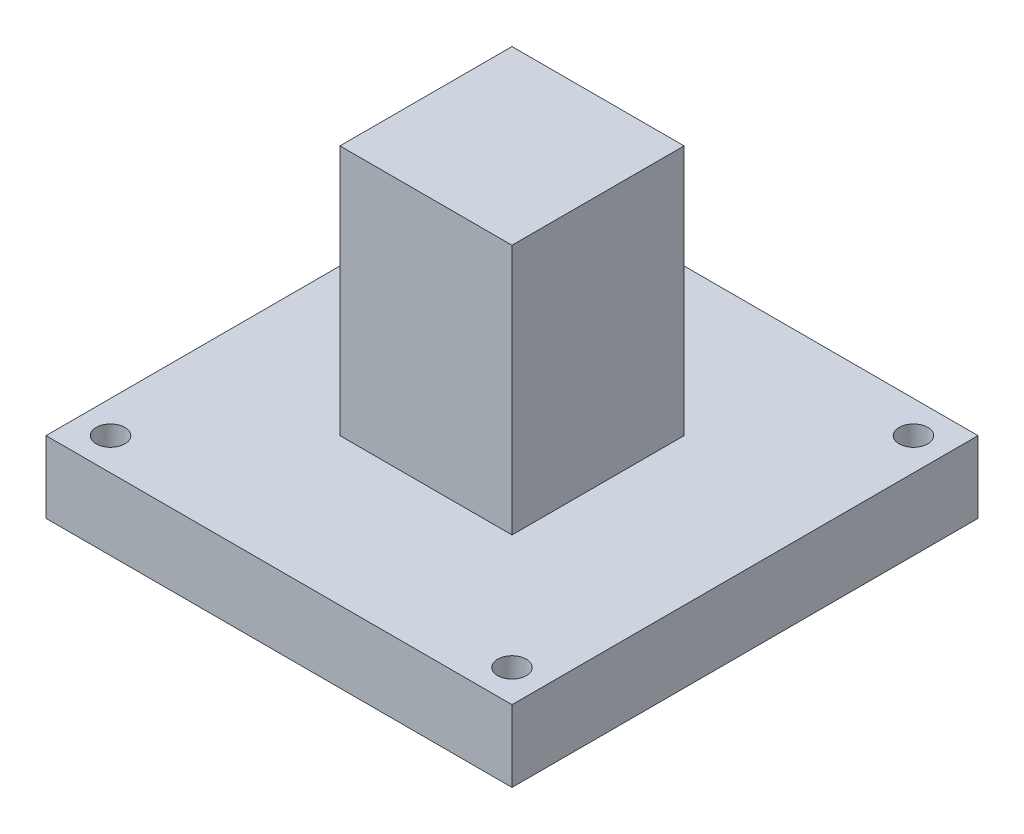
ISO-10303-21;
HEADER;
FILE_DESCRIPTION(('STEP AP214'),'2;1');
FILE_NAME('part.step','',(''),(''),'','','');
FILE_SCHEMA(('AUTOMOTIVE_DESIGN { 1 0 10303 214 1 1 1 1 }'));
ENDSEC;
DATA;
#1=APPLICATION_CONTEXT('core data for automotive mechanical design processes');
#2=APPLICATION_PROTOCOL_DEFINITION('international standard','automotive_design',2000,#1);
#3=PRODUCT_CONTEXT('',#1,'mechanical');
#4=PRODUCT('Part','Part','',(#3));
#5=PRODUCT_RELATED_PRODUCT_CATEGORY('part','',(#4));
#6=PRODUCT_DEFINITION_FORMATION('','',#4);
#7=PRODUCT_DEFINITION_CONTEXT('part definition',#1,'design');
#8=PRODUCT_DEFINITION('design','',#6,#7);
#9=PRODUCT_DEFINITION_SHAPE('','',#8);
#10=(LENGTH_UNIT() NAMED_UNIT(*) SI_UNIT(.MILLI.,.METRE.));
#11=(NAMED_UNIT(*) PLANE_ANGLE_UNIT() SI_UNIT($,.RADIAN.));
#12=(NAMED_UNIT(*) SI_UNIT($,.STERADIAN.) SOLID_ANGLE_UNIT());
#13=UNCERTAINTY_MEASURE_WITH_UNIT(LENGTH_MEASURE(1.E-05),#10,'distance_accuracy_value','');
#14=(GEOMETRIC_REPRESENTATION_CONTEXT(3) GLOBAL_UNCERTAINTY_ASSIGNED_CONTEXT((#13)) GLOBAL_UNIT_ASSIGNED_CONTEXT((#10,
#11,#12)) REPRESENTATION_CONTEXT('',''));
#15=CARTESIAN_POINT('',(0.,0.,0.));
#16=DIRECTION('',(0.,0.,1.));
#17=DIRECTION('',(1.,0.,0.));
#18=AXIS2_PLACEMENT_3D('',#15,#16,#17);
#19=CARTESIAN_POINT('',(0.,35.,0.));
#20=DIRECTION('',(1.,0.,0.));
#21=DIRECTION('',(0.,0.,-1.));
#22=AXIS2_PLACEMENT_3D('',#19,#20,#21);
#23=PLANE('',#22);
#24=DIRECTION('',(0.,0.,1.));
#25=VECTOR('',#24,1.);
#26=CARTESIAN_POINT('',(0.,0.,0.));
#27=LINE('',#26,#25);
#28=CARTESIAN_POINT('',(0.,0.,-24.));
#29=VERTEX_POINT('',#28);
#30=CARTESIAN_POINT('',(0.,0.,0.));
#31=VERTEX_POINT('',#30);
#32=EDGE_CURVE('E129',#29,#31,#27,.T.);
#33=ORIENTED_EDGE('',*,*,#32,.T.);
#34=DIRECTION('',(0.,-1.,0.));
#35=VECTOR('',#34,1.);
#36=CARTESIAN_POINT('',(0.,35.,0.));
#37=LINE('',#36,#35);
#38=CARTESIAN_POINT('',(0.,35.,0.));
#39=VERTEX_POINT('',#38);
#40=EDGE_CURVE('E11',#39,#31,#37,.T.);
#41=ORIENTED_EDGE('',*,*,#40,.F.);
#42=DIRECTION('',(0.,0.,1.));
#43=VECTOR('',#42,1.);
#44=CARTESIAN_POINT('',(0.,35.,0.));
#45=LINE('',#44,#43);
#46=CARTESIAN_POINT('',(0.,35.,-24.));
#47=VERTEX_POINT('',#46);
#48=EDGE_CURVE('E140',#47,#39,#45,.T.);
#49=ORIENTED_EDGE('',*,*,#48,.F.);
#50=DIRECTION('',(0.,-1.,0.));
#51=VECTOR('',#50,1.);
#52=CARTESIAN_POINT('',(0.,35.,-24.));
#53=LINE('',#52,#51);
#54=EDGE_CURVE('E151',#47,#29,#53,.T.);
#55=ORIENTED_EDGE('',*,*,#54,.T.);
#56=EDGE_LOOP('',(#33,#41,#49,#55));
#57=FACE_BOUND('',#56,.T.);
#58=ADVANCED_FACE('F39',(#57),#23,.F.);
#59=CARTESIAN_POINT('',(0.,35.,0.));
#60=DIRECTION('',(0.,0.,-1.));
#61=DIRECTION('',(-1.,0.,0.));
#62=AXIS2_PLACEMENT_3D('',#59,#60,#61);
#63=PLANE('',#62);
#64=DIRECTION('',(1.,0.,0.));
#65=VECTOR('',#64,1.);
#66=CARTESIAN_POINT('',(0.,0.,0.));
#67=LINE('',#66,#65);
#68=CARTESIAN_POINT('',(24.,0.,0.));
#69=VERTEX_POINT('',#68);
#70=EDGE_CURVE('E134',#31,#69,#67,.T.);
#71=ORIENTED_EDGE('',*,*,#70,.T.);
#72=DIRECTION('',(0.,-1.,0.));
#73=VECTOR('',#72,1.);
#74=CARTESIAN_POINT('',(24.,35.,0.));
#75=LINE('',#74,#73);
#76=CARTESIAN_POINT('',(24.,35.,0.));
#77=VERTEX_POINT('',#76);
#78=EDGE_CURVE('E48',#77,#69,#75,.T.);
#79=ORIENTED_EDGE('',*,*,#78,.F.);
#80=DIRECTION('',(1.,0.,0.));
#81=VECTOR('',#80,1.);
#82=CARTESIAN_POINT('',(0.,35.,0.));
#83=LINE('',#82,#81);
#84=EDGE_CURVE('E143',#39,#77,#83,.T.);
#85=ORIENTED_EDGE('',*,*,#84,.F.);
#86=ORIENTED_EDGE('',*,*,#40,.T.);
#87=EDGE_LOOP('',(#71,#79,#85,#86));
#88=FACE_BOUND('',#87,.T.);
#89=ADVANCED_FACE('F178',(#88),#63,.F.);
#90=CARTESIAN_POINT('',(24.,35.,0.));
#91=DIRECTION('',(-1.,0.,0.));
#92=DIRECTION('',(0.,0.,1.));
#93=AXIS2_PLACEMENT_3D('',#90,#91,#92);
#94=PLANE('',#93);
#95=DIRECTION('',(0.,0.,-1.));
#96=VECTOR('',#95,1.);
#97=CARTESIAN_POINT('',(24.,0.,0.));
#98=LINE('',#97,#96);
#99=CARTESIAN_POINT('',(24.,0.,-24.));
#100=VERTEX_POINT('',#99);
#101=EDGE_CURVE('E156',#69,#100,#98,.T.);
#102=ORIENTED_EDGE('',*,*,#101,.T.);
#103=DIRECTION('',(0.,-1.,0.));
#104=VECTOR('',#103,1.);
#105=CARTESIAN_POINT('',(24.,35.,-24.));
#106=LINE('',#105,#104);
#107=CARTESIAN_POINT('',(24.,35.,-24.));
#108=VERTEX_POINT('',#107);
#109=EDGE_CURVE('E166',#108,#100,#106,.T.);
#110=ORIENTED_EDGE('',*,*,#109,.F.);
#111=DIRECTION('',(0.,0.,-1.));
#112=VECTOR('',#111,1.);
#113=CARTESIAN_POINT('',(24.,35.,0.));
#114=LINE('',#113,#112);
#115=EDGE_CURVE('E147',#77,#108,#114,.T.);
#116=ORIENTED_EDGE('',*,*,#115,.F.);
#117=ORIENTED_EDGE('',*,*,#78,.T.);
#118=EDGE_LOOP('',(#102,#110,#116,#117));
#119=FACE_BOUND('',#118,.T.);
#120=ADVANCED_FACE('F174',(#119),#94,.F.);
#121=CARTESIAN_POINT('',(0.,35.,-24.));
#122=DIRECTION('',(0.,0.,1.));
#123=DIRECTION('',(1.,0.,0.));
#124=AXIS2_PLACEMENT_3D('',#121,#122,#123);
#125=PLANE('',#124);
#126=DIRECTION('',(-1.,0.,0.));
#127=VECTOR('',#126,1.);
#128=CARTESIAN_POINT('',(0.,0.,-24.));
#129=LINE('',#128,#127);
#130=EDGE_CURVE('E144',#100,#29,#129,.T.);
#131=ORIENTED_EDGE('',*,*,#130,.T.);
#132=ORIENTED_EDGE('',*,*,#54,.F.);
#133=DIRECTION('',(-1.,0.,0.));
#134=VECTOR('',#133,1.);
#135=CARTESIAN_POINT('',(0.,35.,-24.));
#136=LINE('',#135,#134);
#137=EDGE_CURVE('E55',#108,#47,#136,.T.);
#138=ORIENTED_EDGE('',*,*,#137,.F.);
#139=ORIENTED_EDGE('',*,*,#109,.T.);
#140=EDGE_LOOP('',(#131,#132,#138,#139));
#141=FACE_BOUND('',#140,.T.);
#142=ADVANCED_FACE('F183',(#141),#125,.F.);
#143=CARTESIAN_POINT('',(0.,35.,0.));
#144=DIRECTION('',(0.,-1.,0.));
#145=DIRECTION('',(0.,0.,-1.));
#146=AXIS2_PLACEMENT_3D('',#143,#144,#145);
#147=PLANE('',#146);
#148=ORIENTED_EDGE('',*,*,#48,.T.);
#149=ORIENTED_EDGE('',*,*,#84,.T.);
#150=ORIENTED_EDGE('',*,*,#115,.T.);
#151=ORIENTED_EDGE('',*,*,#137,.T.);
#152=EDGE_LOOP('',(#148,#149,#150,#151));
#153=FACE_BOUND('',#152,.T.);
#154=ADVANCED_FACE('F186',(#153),#147,.F.);
#155=CARTESIAN_POINT('',(0.,0.,0.));
#156=DIRECTION('',(0.,1.,0.));
#157=DIRECTION('',(0.,0.,1.));
#158=AXIS2_PLACEMENT_3D('',#155,#156,#157);
#159=PLANE('',#158);
#160=CARTESIAN_POINT('',(40.,0.,-40.));
#161=DIRECTION('',(0.,-1.,0.));
#162=DIRECTION('',(0.,0.,-1.));
#163=AXIS2_PLACEMENT_3D('',#160,#161,#162);
#164=CIRCLE('',#163,2.);
#165=CARTESIAN_POINT('',(40.,0.,-42.));
#166=VERTEX_POINT('',#165);
#167=EDGE_CURVE('E350',#166,#166,#164,.T.);
#168=ORIENTED_EDGE('',*,*,#167,.T.);
#169=EDGE_LOOP('',(#168));
#170=FACE_BOUND('',#169,.T.);
#171=CARTESIAN_POINT('',(-16.,0.,-40.));
#172=DIRECTION('',(0.,-1.,0.));
#173=DIRECTION('',(0.,0.,-1.));
#174=AXIS2_PLACEMENT_3D('',#171,#172,#173);
#175=CIRCLE('',#174,2.);
#176=CARTESIAN_POINT('',(-16.,0.,-42.));
#177=VERTEX_POINT('',#176);
#178=EDGE_CURVE('E377',#177,#177,#175,.T.);
#179=ORIENTED_EDGE('',*,*,#178,.T.);
#180=EDGE_LOOP('',(#179));
#181=FACE_BOUND('',#180,.T.);
#182=DIRECTION('',(0.,0.,1.));
#183=VECTOR('',#182,1.);
#184=CARTESIAN_POINT('',(44.5,0.,20.5));
#185=LINE('',#184,#183);
#186=CARTESIAN_POINT('',(44.5,0.,-44.5));
#187=VERTEX_POINT('',#186);
#188=CARTESIAN_POINT('',(44.5,0.,20.5));
#189=VERTEX_POINT('',#188);
#190=EDGE_CURVE('E127',#187,#189,#185,.T.);
#191=ORIENTED_EDGE('',*,*,#190,.F.);
#192=DIRECTION('',(1.,0.,0.));
#193=VECTOR('',#192,1.);
#194=CARTESIAN_POINT('',(44.5,0.,-44.5));
#195=LINE('',#194,#193);
#196=CARTESIAN_POINT('',(-20.5,0.,-44.5));
#197=VERTEX_POINT('',#196);
#198=EDGE_CURVE('E123',#197,#187,#195,.T.);
#199=ORIENTED_EDGE('',*,*,#198,.F.);
#200=DIRECTION('',(0.,0.,-1.));
#201=VECTOR('',#200,1.);
#202=CARTESIAN_POINT('',(-20.5,0.,20.5));
#203=LINE('',#202,#201);
#204=CARTESIAN_POINT('',(-20.5,0.,20.5));
#205=VERTEX_POINT('',#204);
#206=EDGE_CURVE('E406',#205,#197,#203,.T.);
#207=ORIENTED_EDGE('',*,*,#206,.F.);
#208=DIRECTION('',(-1.,0.,0.));
#209=VECTOR('',#208,1.);
#210=CARTESIAN_POINT('',(44.5,0.,20.5));
#211=LINE('',#210,#209);
#212=EDGE_CURVE('E403',#189,#205,#211,.T.);
#213=ORIENTED_EDGE('',*,*,#212,.F.);
#214=EDGE_LOOP('',(#191,#199,#207,#213));
#215=FACE_BOUND('',#214,.T.);
#216=CARTESIAN_POINT('',(-16.,0.,16.));
#217=DIRECTION('',(0.,-1.,0.));
#218=DIRECTION('',(0.,0.,-1.));
#219=AXIS2_PLACEMENT_3D('',#216,#217,#218);
#220=CIRCLE('',#219,2.);
#221=CARTESIAN_POINT('',(-16.,0.,14.));
#222=VERTEX_POINT('',#221);
#223=EDGE_CURVE('E385',#222,#222,#220,.T.);
#224=ORIENTED_EDGE('',*,*,#223,.T.);
#225=EDGE_LOOP('',(#224));
#226=FACE_BOUND('',#225,.T.);
#227=CARTESIAN_POINT('',(40.,0.,16.));
#228=DIRECTION('',(0.,-1.,0.));
#229=DIRECTION('',(0.,0.,-1.));
#230=AXIS2_PLACEMENT_3D('',#227,#228,#229);
#231=CIRCLE('',#230,2.);
#232=CARTESIAN_POINT('',(40.,0.,14.));
#233=VERTEX_POINT('',#232);
#234=EDGE_CURVE('E371',#233,#233,#231,.T.);
#235=ORIENTED_EDGE('',*,*,#234,.T.);
#236=EDGE_LOOP('',(#235));
#237=FACE_BOUND('',#236,.T.);
#238=ORIENTED_EDGE('',*,*,#32,.F.);
#239=ORIENTED_EDGE('',*,*,#130,.F.);
#240=ORIENTED_EDGE('',*,*,#101,.F.);
#241=ORIENTED_EDGE('',*,*,#70,.F.);
#242=EDGE_LOOP('',(#238,#239,#240,#241));
#243=FACE_BOUND('',#242,.T.);
#244=ADVANCED_FACE('F181',(#170,#181,#215,#226,#237,#243),#159,.T.);
#245=CARTESIAN_POINT('',(0.,-10.,0.));
#246=DIRECTION('',(0.,1.,0.));
#247=DIRECTION('',(0.,0.,1.));
#248=AXIS2_PLACEMENT_3D('',#245,#246,#247);
#249=PLANE('',#248);
#250=CARTESIAN_POINT('',(12.,-10.,16.));
#251=DIRECTION('',(0.,-1.,0.));
#252=DIRECTION('',(0.,0.,-1.));
#253=AXIS2_PLACEMENT_3D('',#250,#251,#252);
#254=CIRCLE('',#253,2.5);
#255=CARTESIAN_POINT('',(12.,-10.,13.5));
#256=VERTEX_POINT('',#255);
#257=EDGE_CURVE('E351',#256,#256,#254,.T.);
#258=ORIENTED_EDGE('',*,*,#257,.F.);
#259=EDGE_LOOP('',(#258));
#260=FACE_BOUND('',#259,.T.);
#261=CARTESIAN_POINT('',(12.,-10.,-40.));
#262=DIRECTION('',(0.,-1.,0.));
#263=DIRECTION('',(0.,0.,-1.));
#264=AXIS2_PLACEMENT_3D('',#261,#262,#263);
#265=CIRCLE('',#264,2.5);
#266=CARTESIAN_POINT('',(12.,-10.,-42.5));
#267=VERTEX_POINT('',#266);
#268=EDGE_CURVE('E365',#267,#267,#265,.T.);
#269=ORIENTED_EDGE('',*,*,#268,.F.);
#270=EDGE_LOOP('',(#269));
#271=FACE_BOUND('',#270,.T.);
#272=DIRECTION('',(0.,0.,1.));
#273=VECTOR('',#272,1.);
#274=CARTESIAN_POINT('',(44.5,-10.,20.5));
#275=LINE('',#274,#273);
#276=CARTESIAN_POINT('',(44.5,-10.,-44.5));
#277=VERTEX_POINT('',#276);
#278=CARTESIAN_POINT('',(44.5,-10.,20.5));
#279=VERTEX_POINT('',#278);
#280=EDGE_CURVE('E112',#277,#279,#275,.T.);
#281=ORIENTED_EDGE('',*,*,#280,.T.);
#282=DIRECTION('',(-1.,0.,0.));
#283=VECTOR('',#282,1.);
#284=CARTESIAN_POINT('',(44.5,-10.,20.5));
#285=LINE('',#284,#283);
#286=CARTESIAN_POINT('',(-20.5,-10.,20.5));
#287=VERTEX_POINT('',#286);
#288=EDGE_CURVE('E100',#279,#287,#285,.T.);
#289=ORIENTED_EDGE('',*,*,#288,.T.);
#290=DIRECTION('',(0.,0.,-1.));
#291=VECTOR('',#290,1.);
#292=CARTESIAN_POINT('',(-20.5,-10.,20.5));
#293=LINE('',#292,#291);
#294=CARTESIAN_POINT('',(-20.5,-10.,-44.5));
#295=VERTEX_POINT('',#294);
#296=EDGE_CURVE('E111',#287,#295,#293,.T.);
#297=ORIENTED_EDGE('',*,*,#296,.T.);
#298=DIRECTION('',(1.,0.,0.));
#299=VECTOR('',#298,1.);
#300=CARTESIAN_POINT('',(44.5,-10.,-44.5));
#301=LINE('',#300,#299);
#302=EDGE_CURVE('E118',#295,#277,#301,.T.);
#303=ORIENTED_EDGE('',*,*,#302,.T.);
#304=EDGE_LOOP('',(#281,#289,#297,#303));
#305=FACE_BOUND('',#304,.T.);
#306=CARTESIAN_POINT('',(-16.,-10.,16.));
#307=DIRECTION('',(0.,-1.,0.));
#308=DIRECTION('',(0.,0.,-1.));
#309=AXIS2_PLACEMENT_3D('',#306,#307,#308);
#310=CIRCLE('',#309,2.);
#311=CARTESIAN_POINT('',(-16.,-10.,14.));
#312=VERTEX_POINT('',#311);
#313=EDGE_CURVE('E389',#312,#312,#310,.T.);
#314=ORIENTED_EDGE('',*,*,#313,.F.);
#315=EDGE_LOOP('',(#314));
#316=FACE_BOUND('',#315,.T.);
#317=CARTESIAN_POINT('',(-16.,-10.,-40.));
#318=DIRECTION('',(0.,-1.,0.));
#319=DIRECTION('',(0.,0.,-1.));
#320=AXIS2_PLACEMENT_3D('',#317,#318,#319);
#321=CIRCLE('',#320,2.);
#322=CARTESIAN_POINT('',(-16.,-10.,-42.));
#323=VERTEX_POINT('',#322);
#324=EDGE_CURVE('E381',#323,#323,#321,.T.);
#325=ORIENTED_EDGE('',*,*,#324,.F.);
#326=EDGE_LOOP('',(#325));
#327=FACE_BOUND('',#326,.T.);
#328=CARTESIAN_POINT('',(40.,-10.,16.));
#329=DIRECTION('',(0.,-1.,0.));
#330=DIRECTION('',(0.,0.,-1.));
#331=AXIS2_PLACEMENT_3D('',#328,#329,#330);
#332=CIRCLE('',#331,2.);
#333=CARTESIAN_POINT('',(40.,-10.,14.));
#334=VERTEX_POINT('',#333);
#335=EDGE_CURVE('E373',#334,#334,#332,.T.);
#336=ORIENTED_EDGE('',*,*,#335,.F.);
#337=EDGE_LOOP('',(#336));
#338=FACE_BOUND('',#337,.T.);
#339=CARTESIAN_POINT('',(40.,-10.,-40.));
#340=DIRECTION('',(0.,-1.,0.));
#341=DIRECTION('',(0.,0.,-1.));
#342=AXIS2_PLACEMENT_3D('',#339,#340,#341);
#343=CIRCLE('',#342,2.);
#344=CARTESIAN_POINT('',(40.,-10.,-42.));
#345=VERTEX_POINT('',#344);
#346=EDGE_CURVE('E356',#345,#345,#343,.T.);
#347=ORIENTED_EDGE('',*,*,#346,.F.);
#348=EDGE_LOOP('',(#347));
#349=FACE_BOUND('',#348,.T.);
#350=ADVANCED_FACE('F115',(#260,#271,#305,#316,#327,#338,#349),#249,.F.);
#351=CARTESIAN_POINT('',(44.5,-10.,20.5));
#352=DIRECTION('',(-1.,0.,0.));
#353=DIRECTION('',(0.,0.,1.));
#354=AXIS2_PLACEMENT_3D('',#351,#352,#353);
#355=PLANE('',#354);
#356=ORIENTED_EDGE('',*,*,#190,.T.);
#357=DIRECTION('',(0.,1.,0.));
#358=VECTOR('',#357,1.);
#359=CARTESIAN_POINT('',(44.5,-10.,20.5));
#360=LINE('',#359,#358);
#361=EDGE_CURVE('E104',#279,#189,#360,.T.);
#362=ORIENTED_EDGE('',*,*,#361,.F.);
#363=ORIENTED_EDGE('',*,*,#280,.F.);
#364=DIRECTION('',(0.,1.,0.));
#365=VECTOR('',#364,1.);
#366=CARTESIAN_POINT('',(44.5,-10.,-44.5));
#367=LINE('',#366,#365);
#368=EDGE_CURVE('E400',#277,#187,#367,.T.);
#369=ORIENTED_EDGE('',*,*,#368,.T.);
#370=EDGE_LOOP('',(#356,#362,#363,#369));
#371=FACE_BOUND('',#370,.T.);
#372=ADVANCED_FACE('F125',(#371),#355,.F.);
#373=CARTESIAN_POINT('',(44.5,-10.,20.5));
#374=DIRECTION('',(0.,0.,-1.));
#375=DIRECTION('',(-1.,0.,0.));
#376=AXIS2_PLACEMENT_3D('',#373,#374,#375);
#377=PLANE('',#376);
#378=ORIENTED_EDGE('',*,*,#212,.T.);
#379=DIRECTION('',(0.,1.,0.));
#380=VECTOR('',#379,1.);
#381=CARTESIAN_POINT('',(-20.5,-10.,20.5));
#382=LINE('',#381,#380);
#383=EDGE_CURVE('E107',#287,#205,#382,.T.);
#384=ORIENTED_EDGE('',*,*,#383,.F.);
#385=ORIENTED_EDGE('',*,*,#288,.F.);
#386=ORIENTED_EDGE('',*,*,#361,.T.);
#387=EDGE_LOOP('',(#378,#384,#385,#386));
#388=FACE_BOUND('',#387,.T.);
#389=ADVANCED_FACE('F102',(#388),#377,.F.);
#390=CARTESIAN_POINT('',(-20.5,-10.,20.5));
#391=DIRECTION('',(1.,0.,0.));
#392=DIRECTION('',(0.,0.,-1.));
#393=AXIS2_PLACEMENT_3D('',#390,#391,#392);
#394=PLANE('',#393);
#395=ORIENTED_EDGE('',*,*,#206,.T.);
#396=DIRECTION('',(0.,1.,0.));
#397=VECTOR('',#396,1.);
#398=CARTESIAN_POINT('',(-20.5,-10.,-44.5));
#399=LINE('',#398,#397);
#400=EDGE_CURVE('E136',#295,#197,#399,.T.);
#401=ORIENTED_EDGE('',*,*,#400,.F.);
#402=ORIENTED_EDGE('',*,*,#296,.F.);
#403=ORIENTED_EDGE('',*,*,#383,.T.);
#404=EDGE_LOOP('',(#395,#401,#402,#403));
#405=FACE_BOUND('',#404,.T.);
#406=ADVANCED_FACE('F236',(#405),#394,.F.);
#407=CARTESIAN_POINT('',(44.5,-10.,-44.5));
#408=DIRECTION('',(0.,0.,1.));
#409=DIRECTION('',(1.,0.,0.));
#410=AXIS2_PLACEMENT_3D('',#407,#408,#409);
#411=PLANE('',#410);
#412=ORIENTED_EDGE('',*,*,#198,.T.);
#413=ORIENTED_EDGE('',*,*,#368,.F.);
#414=ORIENTED_EDGE('',*,*,#302,.F.);
#415=ORIENTED_EDGE('',*,*,#400,.T.);
#416=EDGE_LOOP('',(#412,#413,#414,#415));
#417=FACE_BOUND('',#416,.T.);
#418=ADVANCED_FACE('F245',(#417),#411,.F.);
#419=CARTESIAN_POINT('',(-16.,-10.,16.));
#420=DIRECTION('',(0.,1.,0.));
#421=DIRECTION('',(0.,0.,1.));
#422=AXIS2_PLACEMENT_3D('',#419,#420,#421);
#423=CYLINDRICAL_SURFACE('',#422,2.);
#424=ORIENTED_EDGE('',*,*,#313,.T.);
#425=EDGE_LOOP('',(#424));
#426=FACE_BOUND('',#425,.T.);
#427=ORIENTED_EDGE('',*,*,#223,.F.);
#428=EDGE_LOOP('',(#427));
#429=FACE_BOUND('',#428,.T.);
#430=ADVANCED_FACE('F255',(#426,#429),#423,.F.);
#431=CARTESIAN_POINT('',(-16.,-10.,-40.));
#432=DIRECTION('',(0.,1.,0.));
#433=DIRECTION('',(0.,0.,1.));
#434=AXIS2_PLACEMENT_3D('',#431,#432,#433);
#435=CYLINDRICAL_SURFACE('',#434,2.);
#436=ORIENTED_EDGE('',*,*,#324,.T.);
#437=EDGE_LOOP('',(#436));
#438=FACE_BOUND('',#437,.T.);
#439=ORIENTED_EDGE('',*,*,#178,.F.);
#440=EDGE_LOOP('',(#439));
#441=FACE_BOUND('',#440,.T.);
#442=ADVANCED_FACE('F265',(#438,#441),#435,.F.);
#443=CARTESIAN_POINT('',(40.,-10.,16.));
#444=DIRECTION('',(0.,1.,0.));
#445=DIRECTION('',(0.,0.,1.));
#446=AXIS2_PLACEMENT_3D('',#443,#444,#445);
#447=CYLINDRICAL_SURFACE('',#446,2.);
#448=ORIENTED_EDGE('',*,*,#335,.T.);
#449=EDGE_LOOP('',(#448));
#450=FACE_BOUND('',#449,.T.);
#451=ORIENTED_EDGE('',*,*,#234,.F.);
#452=EDGE_LOOP('',(#451));
#453=FACE_BOUND('',#452,.T.);
#454=ADVANCED_FACE('F275',(#450,#453),#447,.F.);
#455=CARTESIAN_POINT('',(40.,-10.,-40.));
#456=DIRECTION('',(0.,1.,0.));
#457=DIRECTION('',(0.,0.,1.));
#458=AXIS2_PLACEMENT_3D('',#455,#456,#457);
#459=CYLINDRICAL_SURFACE('',#458,2.);
#460=ORIENTED_EDGE('',*,*,#346,.T.);
#461=EDGE_LOOP('',(#460));
#462=FACE_BOUND('',#461,.T.);
#463=ORIENTED_EDGE('',*,*,#167,.F.);
#464=EDGE_LOOP('',(#463));
#465=FACE_BOUND('',#464,.T.);
#466=ADVANCED_FACE('F285',(#462,#465),#459,.F.);
#467=CARTESIAN_POINT('',(12.,-3.,-40.));
#468=DIRECTION('',(0.,-1.,0.));
#469=DIRECTION('',(0.,0.,-1.));
#470=AXIS2_PLACEMENT_3D('',#467,#468,#469);
#471=CYLINDRICAL_SURFACE('',#470,2.5);
#472=CARTESIAN_POINT('',(12.,-3.,-40.));
#473=DIRECTION('',(0.,-1.,0.));
#474=DIRECTION('',(0.,0.,-1.));
#475=AXIS2_PLACEMENT_3D('',#472,#473,#474);
#476=CIRCLE('',#475,2.5);
#477=CARTESIAN_POINT('',(12.,-3.,-42.5));
#478=VERTEX_POINT('',#477);
#479=EDGE_CURVE('E359',#478,#478,#476,.T.);
#480=ORIENTED_EDGE('',*,*,#479,.F.);
#481=EDGE_LOOP('',(#480));
#482=FACE_BOUND('',#481,.T.);
#483=ORIENTED_EDGE('',*,*,#268,.T.);
#484=EDGE_LOOP('',(#483));
#485=FACE_BOUND('',#484,.T.);
#486=ADVANCED_FACE('F295',(#482,#485),#471,.F.);
#487=CARTESIAN_POINT('',(12.,-3.,-40.));
#488=DIRECTION('',(0.,-1.,0.));
#489=DIRECTION('',(0.,0.,-1.));
#490=AXIS2_PLACEMENT_3D('',#487,#488,#489);
#491=PLANE('',#490);
#492=ORIENTED_EDGE('',*,*,#479,.T.);
#493=EDGE_LOOP('',(#492));
#494=FACE_BOUND('',#493,.T.);
#495=ADVANCED_FACE('F312',(#494),#491,.T.);
#496=CARTESIAN_POINT('',(12.,-3.,16.));
#497=DIRECTION('',(0.,-1.,0.));
#498=DIRECTION('',(0.,0.,-1.));
#499=AXIS2_PLACEMENT_3D('',#496,#497,#498);
#500=CYLINDRICAL_SURFACE('',#499,2.5);
#501=CARTESIAN_POINT('',(12.,-3.,16.));
#502=DIRECTION('',(0.,-1.,0.));
#503=DIRECTION('',(0.,0.,-1.));
#504=AXIS2_PLACEMENT_3D('',#501,#502,#503);
#505=CIRCLE('',#504,2.5);
#506=CARTESIAN_POINT('',(12.,-3.,13.5));
#507=VERTEX_POINT('',#506);
#508=EDGE_CURVE('E348',#507,#507,#505,.T.);
#509=ORIENTED_EDGE('',*,*,#508,.F.);
#510=EDGE_LOOP('',(#509));
#511=FACE_BOUND('',#510,.T.);
#512=ORIENTED_EDGE('',*,*,#257,.T.);
#513=EDGE_LOOP('',(#512));
#514=FACE_BOUND('',#513,.T.);
#515=ADVANCED_FACE('F322',(#511,#514),#500,.F.);
#516=CARTESIAN_POINT('',(12.,-3.,16.));
#517=DIRECTION('',(0.,-1.,0.));
#518=DIRECTION('',(0.,0.,-1.));
#519=AXIS2_PLACEMENT_3D('',#516,#517,#518);
#520=PLANE('',#519);
#521=ORIENTED_EDGE('',*,*,#508,.T.);
#522=EDGE_LOOP('',(#521));
#523=FACE_BOUND('',#522,.T.);
#524=ADVANCED_FACE('F332',(#523),#520,.T.);
#525=CLOSED_SHELL('',(#58,#89,#120,#142,#154,#244,#350,#372,#389,#406,#418,#430,#442,#454,#466,
#486,#495,#515,#524));
#526=MANIFOLD_SOLID_BREP('B2',#525);
#527=ADVANCED_BREP_SHAPE_REPRESENTATION('',(#18,#526),#14);
#528=SHAPE_DEFINITION_REPRESENTATION(#9,#527);
ENDSEC;
END-ISO-10303-21;
